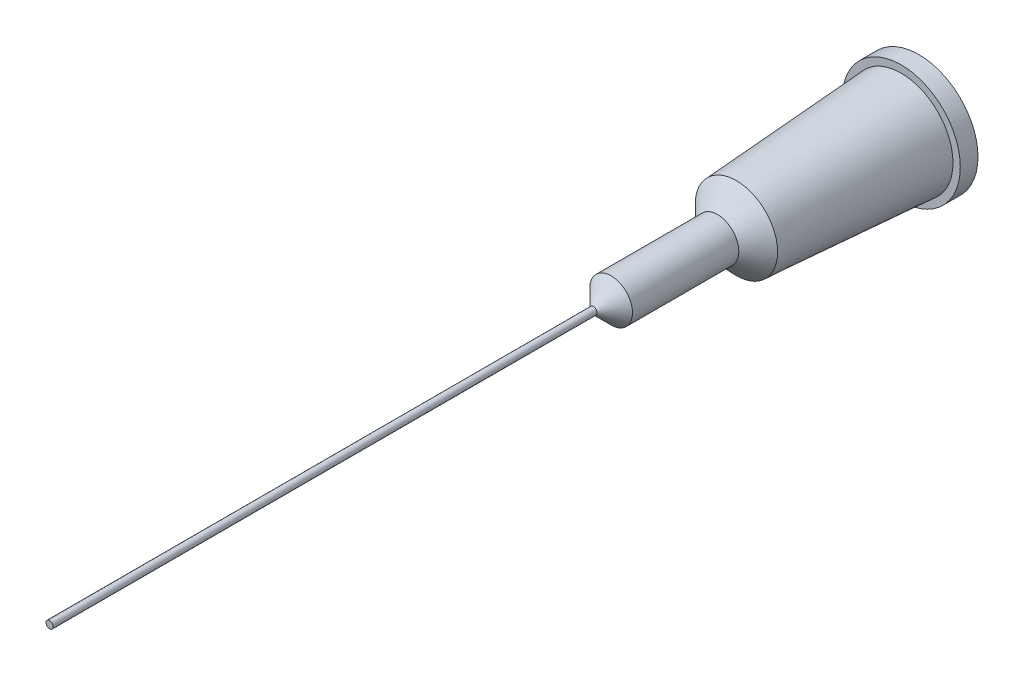
ISO-10303-21;
HEADER;
FILE_DESCRIPTION(('STEP AP214'),'2;1');
FILE_NAME('part.step','',(''),(''),'','','');
FILE_SCHEMA(('AUTOMOTIVE_DESIGN { 1 0 10303 214 1 1 1 1 }'));
ENDSEC;
DATA;
#1=APPLICATION_CONTEXT('core data for automotive mechanical design processes');
#2=APPLICATION_PROTOCOL_DEFINITION('international standard','automotive_design',2000,#1);
#3=PRODUCT_CONTEXT('',#1,'mechanical');
#4=PRODUCT('Part','Part','',(#3));
#5=PRODUCT_RELATED_PRODUCT_CATEGORY('part','',(#4));
#6=PRODUCT_DEFINITION_FORMATION('','',#4);
#7=PRODUCT_DEFINITION_CONTEXT('part definition',#1,'design');
#8=PRODUCT_DEFINITION('design','',#6,#7);
#9=PRODUCT_DEFINITION_SHAPE('','',#8);
#10=(LENGTH_UNIT() NAMED_UNIT(*) SI_UNIT(.MILLI.,.METRE.));
#11=(NAMED_UNIT(*) PLANE_ANGLE_UNIT() SI_UNIT($,.RADIAN.));
#12=(NAMED_UNIT(*) SI_UNIT($,.STERADIAN.) SOLID_ANGLE_UNIT());
#13=UNCERTAINTY_MEASURE_WITH_UNIT(LENGTH_MEASURE(1.E-05),#10,'distance_accuracy_value','');
#14=(GEOMETRIC_REPRESENTATION_CONTEXT(3) GLOBAL_UNCERTAINTY_ASSIGNED_CONTEXT((#13)) GLOBAL_UNIT_ASSIGNED_CONTEXT((#10,
#11,#12)) REPRESENTATION_CONTEXT('',''));
#15=CARTESIAN_POINT('',(0.,0.,0.));
#16=DIRECTION('',(0.,0.,1.));
#17=DIRECTION('',(1.,0.,0.));
#18=AXIS2_PLACEMENT_3D('',#15,#16,#17);
#19=CARTESIAN_POINT('',(0.,0.,1.));
#20=DIRECTION('',(0.,0.,-1.));
#21=DIRECTION('',(-1.,0.,0.));
#22=AXIS2_PLACEMENT_3D('',#19,#20,#21);
#23=CONICAL_SURFACE('',#22,2.925,0.0644268394255535);
#24=CARTESIAN_POINT('',(0.,0.,10.3));
#25=DIRECTION('',(0.,0.,1.));
#26=DIRECTION('',(1.,0.,0.));
#27=AXIS2_PLACEMENT_3D('',#24,#25,#26);
#28=CIRCLE('',#27,2.325);
#29=CARTESIAN_POINT('',(2.325,0.,10.3));
#30=VERTEX_POINT('',#29);
#31=EDGE_CURVE('E10',#30,#30,#28,.T.);
#32=ORIENTED_EDGE('',*,*,#31,.F.);
#33=EDGE_LOOP('',(#32));
#34=FACE_BOUND('',#33,.T.);
#35=CARTESIAN_POINT('',(0.,0.,1.));
#36=DIRECTION('',(0.,0.,1.));
#37=DIRECTION('',(1.,0.,0.));
#38=AXIS2_PLACEMENT_3D('',#35,#36,#37);
#39=CIRCLE('',#38,2.925);
#40=CARTESIAN_POINT('',(2.925,0.,1.));
#41=VERTEX_POINT('',#40);
#42=EDGE_CURVE('E59',#41,#41,#39,.T.);
#43=ORIENTED_EDGE('',*,*,#42,.T.);
#44=EDGE_LOOP('',(#43));
#45=FACE_BOUND('',#44,.T.);
#46=ADVANCED_FACE('F31',(#34,#45),#23,.T.);
#47=CARTESIAN_POINT('',(0.,0.,10.3));
#48=DIRECTION('',(0.,0.,-1.));
#49=DIRECTION('',(-1.,0.,0.));
#50=AXIS2_PLACEMENT_3D('',#47,#48,#49);
#51=CONICAL_SURFACE('',#50,2.325,0.808225247918833);
#52=CARTESIAN_POINT('',(0.,0.,11.37));
#53=DIRECTION('',(0.,0.,1.));
#54=DIRECTION('',(1.,0.,0.));
#55=AXIS2_PLACEMENT_3D('',#52,#53,#54);
#56=CIRCLE('',#55,1.205);
#57=CARTESIAN_POINT('',(1.205,0.,11.37));
#58=VERTEX_POINT('',#57);
#59=EDGE_CURVE('E37',#58,#58,#56,.T.);
#60=ORIENTED_EDGE('',*,*,#59,.F.);
#61=EDGE_LOOP('',(#60));
#62=FACE_BOUND('',#61,.T.);
#63=ORIENTED_EDGE('',*,*,#31,.T.);
#64=EDGE_LOOP('',(#63));
#65=FACE_BOUND('',#64,.T.);
#66=ADVANCED_FACE('F87',(#62,#65),#51,.T.);
#67=CARTESIAN_POINT('',(0.,0.,49.06));
#68=DIRECTION('',(0.,0.,1.));
#69=DIRECTION('',(1.,0.,0.));
#70=AXIS2_PLACEMENT_3D('',#67,#68,#69);
#71=CYLINDRICAL_SURFACE('',#70,1.205);
#72=CARTESIAN_POINT('',(0.,0.,17.37));
#73=DIRECTION('',(0.,0.,1.));
#74=DIRECTION('',(1.,0.,0.));
#75=AXIS2_PLACEMENT_3D('',#72,#73,#74);
#76=CIRCLE('',#75,1.205);
#77=CARTESIAN_POINT('',(1.205,0.,17.37));
#78=VERTEX_POINT('',#77);
#79=EDGE_CURVE('E41',#78,#78,#76,.T.);
#80=ORIENTED_EDGE('',*,*,#79,.F.);
#81=EDGE_LOOP('',(#80));
#82=FACE_BOUND('',#81,.T.);
#83=ORIENTED_EDGE('',*,*,#59,.T.);
#84=EDGE_LOOP('',(#83));
#85=FACE_BOUND('',#84,.T.);
#86=ADVANCED_FACE('F92',(#82,#85),#71,.T.);
#87=CARTESIAN_POINT('',(0.,0.,17.37));
#88=DIRECTION('',(0.,0.,-1.));
#89=DIRECTION('',(-1.,0.,0.));
#90=AXIS2_PLACEMENT_3D('',#87,#88,#89);
#91=CONICAL_SURFACE('',#90,1.205,0.785398163397453);
#92=CARTESIAN_POINT('',(0.,0.,18.37));
#93=DIRECTION('',(0.,0.,1.));
#94=DIRECTION('',(1.,0.,0.));
#95=AXIS2_PLACEMENT_3D('',#92,#93,#94);
#96=CIRCLE('',#95,0.205);
#97=CARTESIAN_POINT('',(0.205,0.,18.37));
#98=VERTEX_POINT('',#97);
#99=EDGE_CURVE('E45',#98,#98,#96,.T.);
#100=ORIENTED_EDGE('',*,*,#99,.F.);
#101=EDGE_LOOP('',(#100));
#102=FACE_BOUND('',#101,.T.);
#103=ORIENTED_EDGE('',*,*,#79,.T.);
#104=EDGE_LOOP('',(#103));
#105=FACE_BOUND('',#104,.T.);
#106=ADVANCED_FACE('F97',(#102,#105),#91,.T.);
#107=CARTESIAN_POINT('',(0.,0.,49.06));
#108=DIRECTION('',(0.,0.,1.));
#109=DIRECTION('',(1.,0.,0.));
#110=AXIS2_PLACEMENT_3D('',#107,#108,#109);
#111=CYLINDRICAL_SURFACE('',#110,0.204999999999998);
#112=CARTESIAN_POINT('',(0.,0.,49.06));
#113=DIRECTION('',(0.,0.,1.));
#114=DIRECTION('',(1.,0.,0.));
#115=AXIS2_PLACEMENT_3D('',#112,#113,#114);
#116=CIRCLE('',#115,0.204999999999997);
#117=CARTESIAN_POINT('',(0.204999999999997,0.,49.06));
#118=VERTEX_POINT('',#117);
#119=EDGE_CURVE('E50',#118,#118,#116,.T.);
#120=ORIENTED_EDGE('',*,*,#119,.F.);
#121=EDGE_LOOP('',(#120));
#122=FACE_BOUND('',#121,.T.);
#123=ORIENTED_EDGE('',*,*,#99,.T.);
#124=EDGE_LOOP('',(#123));
#125=FACE_BOUND('',#124,.T.);
#126=ADVANCED_FACE('F83',(#122,#125),#111,.T.);
#127=CARTESIAN_POINT('',(-0.204999999999997,0.,49.06));
#128=DIRECTION('',(0.,0.,-1.));
#129=DIRECTION('',(-1.,0.,0.));
#130=AXIS2_PLACEMENT_3D('',#127,#128,#129);
#131=PLANE('',#130);
#132=ORIENTED_EDGE('',*,*,#119,.T.);
#133=EDGE_LOOP('',(#132));
#134=FACE_BOUND('',#133,.T.);
#135=ADVANCED_FACE('F78',(#134),#131,.F.);
#136=CARTESIAN_POINT('',(0.,0.,0.));
#137=DIRECTION('',(0.,0.,1.));
#138=DIRECTION('',(1.,0.,0.));
#139=AXIS2_PLACEMENT_3D('',#136,#137,#138);
#140=PLANE('',#139);
#141=CARTESIAN_POINT('',(0.,0.,0.));
#142=DIRECTION('',(0.,0.,1.));
#143=DIRECTION('',(1.,0.,0.));
#144=AXIS2_PLACEMENT_3D('',#141,#142,#143);
#145=CIRCLE('',#144,3.335);
#146=CARTESIAN_POINT('',(3.335,0.,0.));
#147=VERTEX_POINT('',#146);
#148=EDGE_CURVE('E53',#147,#147,#145,.T.);
#149=ORIENTED_EDGE('',*,*,#148,.F.);
#150=EDGE_LOOP('',(#149));
#151=FACE_BOUND('',#150,.T.);
#152=ADVANCED_FACE('F73',(#151),#140,.F.);
#153=CARTESIAN_POINT('',(0.,0.,49.06));
#154=DIRECTION('',(0.,0.,1.));
#155=DIRECTION('',(1.,0.,0.));
#156=AXIS2_PLACEMENT_3D('',#153,#154,#155);
#157=CYLINDRICAL_SURFACE('',#156,3.335);
#158=CARTESIAN_POINT('',(0.,0.,1.));
#159=DIRECTION('',(0.,0.,1.));
#160=DIRECTION('',(1.,0.,0.));
#161=AXIS2_PLACEMENT_3D('',#158,#159,#160);
#162=CIRCLE('',#161,3.335);
#163=CARTESIAN_POINT('',(3.335,0.,1.));
#164=VERTEX_POINT('',#163);
#165=EDGE_CURVE('E56',#164,#164,#162,.T.);
#166=ORIENTED_EDGE('',*,*,#165,.F.);
#167=EDGE_LOOP('',(#166));
#168=FACE_BOUND('',#167,.T.);
#169=ORIENTED_EDGE('',*,*,#148,.T.);
#170=EDGE_LOOP('',(#169));
#171=FACE_BOUND('',#170,.T.);
#172=ADVANCED_FACE('F67',(#168,#171),#157,.T.);
#173=CARTESIAN_POINT('',(-3.335,0.,1.));
#174=DIRECTION('',(0.,0.,-1.));
#175=DIRECTION('',(-1.,0.,0.));
#176=AXIS2_PLACEMENT_3D('',#173,#174,#175);
#177=PLANE('',#176);
#178=ORIENTED_EDGE('',*,*,#42,.F.);
#179=EDGE_LOOP('',(#178));
#180=FACE_BOUND('',#179,.T.);
#181=ORIENTED_EDGE('',*,*,#165,.T.);
#182=EDGE_LOOP('',(#181));
#183=FACE_BOUND('',#182,.T.);
#184=ADVANCED_FACE('F64',(#180,#183),#177,.F.);
#185=CLOSED_SHELL('',(#46,#66,#86,#106,#126,#135,#152,#172,#184));
#186=MANIFOLD_SOLID_BREP('B2',#185);
#187=ADVANCED_BREP_SHAPE_REPRESENTATION('',(#18,#186),#14);
#188=SHAPE_DEFINITION_REPRESENTATION(#9,#187);
ENDSEC;
END-ISO-10303-21;
